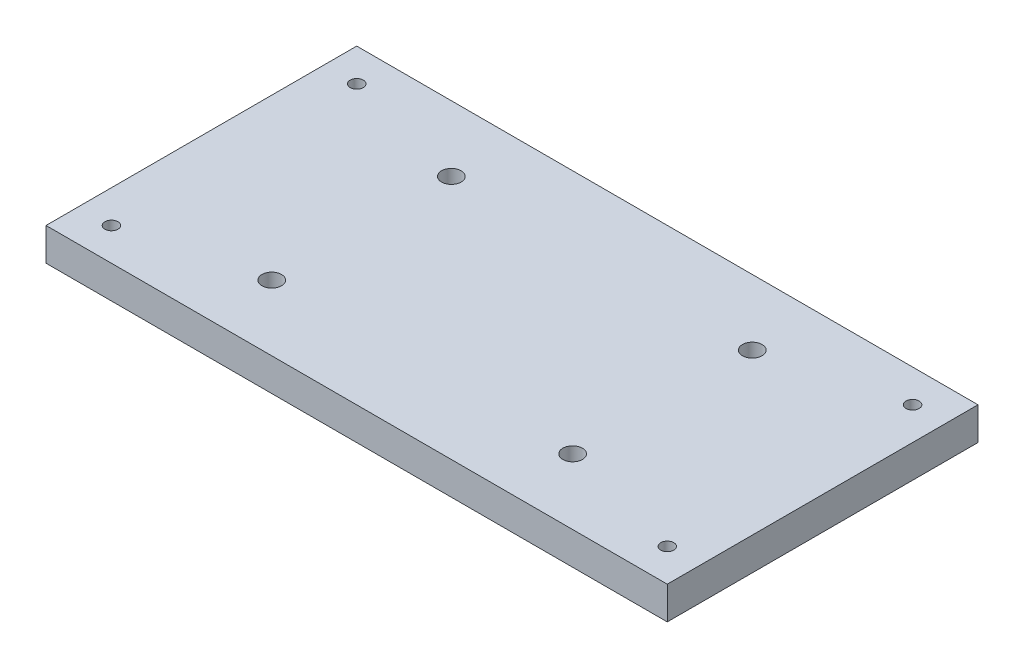
ISO-10303-21;
HEADER;
FILE_DESCRIPTION(('STEP AP214'),'2;1');
FILE_NAME('part.step','',(''),(''),'','','');
FILE_SCHEMA(('AUTOMOTIVE_DESIGN { 1 0 10303 214 1 1 1 1 }'));
ENDSEC;
DATA;
#1=APPLICATION_CONTEXT('core data for automotive mechanical design processes');
#2=APPLICATION_PROTOCOL_DEFINITION('international standard','automotive_design',2000,#1);
#3=PRODUCT_CONTEXT('',#1,'mechanical');
#4=PRODUCT('Part','Part','',(#3));
#5=PRODUCT_RELATED_PRODUCT_CATEGORY('part','',(#4));
#6=PRODUCT_DEFINITION_FORMATION('','',#4);
#7=PRODUCT_DEFINITION_CONTEXT('part definition',#1,'design');
#8=PRODUCT_DEFINITION('design','',#6,#7);
#9=PRODUCT_DEFINITION_SHAPE('','',#8);
#10=(LENGTH_UNIT() NAMED_UNIT(*) SI_UNIT(.MILLI.,.METRE.));
#11=(NAMED_UNIT(*) PLANE_ANGLE_UNIT() SI_UNIT($,.RADIAN.));
#12=(NAMED_UNIT(*) SI_UNIT($,.STERADIAN.) SOLID_ANGLE_UNIT());
#13=UNCERTAINTY_MEASURE_WITH_UNIT(LENGTH_MEASURE(1.E-05),#10,'distance_accuracy_value','');
#14=(GEOMETRIC_REPRESENTATION_CONTEXT(3) GLOBAL_UNCERTAINTY_ASSIGNED_CONTEXT((#13)) GLOBAL_UNIT_ASSIGNED_CONTEXT((#10,
#11,#12)) REPRESENTATION_CONTEXT('',''));
#15=CARTESIAN_POINT('',(0.,0.,0.));
#16=DIRECTION('',(0.,0.,1.));
#17=DIRECTION('',(1.,0.,0.));
#18=AXIS2_PLACEMENT_3D('',#15,#16,#17);
#19=CARTESIAN_POINT('',(0.,10.,52.7085041409592));
#20=DIRECTION('',(0.,0.,1.));
#21=DIRECTION('',(1.,0.,0.));
#22=AXIS2_PLACEMENT_3D('',#19,#20,#21);
#23=PLANE('',#22);
#24=DIRECTION('',(-1.,0.,0.));
#25=VECTOR('',#24,1.);
#26=CARTESIAN_POINT('',(0.,0.,52.7085041409592));
#27=LINE('',#26,#25);
#28=CARTESIAN_POINT('',(88.5827377095665,0.,52.7085041409592));
#29=VERTEX_POINT('',#28);
#30=CARTESIAN_POINT('',(-101.367262290434,0.,52.7085041409592));
#31=VERTEX_POINT('',#30);
#32=EDGE_CURVE('E121',#29,#31,#27,.T.);
#33=ORIENTED_EDGE('',*,*,#32,.F.);
#34=DIRECTION('',(0.,-1.,0.));
#35=VECTOR('',#34,1.);
#36=CARTESIAN_POINT('',(88.5827377095665,10.,52.7085041409592));
#37=LINE('',#36,#35);
#38=CARTESIAN_POINT('',(88.5827377095665,10.,52.7085041409592));
#39=VERTEX_POINT('',#38);
#40=EDGE_CURVE('E11',#39,#29,#37,.T.);
#41=ORIENTED_EDGE('',*,*,#40,.F.);
#42=DIRECTION('',(-1.,0.,0.));
#43=VECTOR('',#42,1.);
#44=CARTESIAN_POINT('',(0.,10.,52.7085041409592));
#45=LINE('',#44,#43);
#46=CARTESIAN_POINT('',(-101.367262290434,10.,52.7085041409592));
#47=VERTEX_POINT('',#46);
#48=EDGE_CURVE('E93',#39,#47,#45,.T.);
#49=ORIENTED_EDGE('',*,*,#48,.T.);
#50=DIRECTION('',(0.,-1.,0.));
#51=VECTOR('',#50,1.);
#52=CARTESIAN_POINT('',(-101.367262290434,10.,52.7085041409592));
#53=LINE('',#52,#51);
#54=EDGE_CURVE('E73',#47,#31,#53,.T.);
#55=ORIENTED_EDGE('',*,*,#54,.T.);
#56=EDGE_LOOP('',(#33,#41,#49,#55));
#57=FACE_BOUND('',#56,.T.);
#58=ADVANCED_FACE('F35',(#57),#23,.T.);
#59=CARTESIAN_POINT('',(88.5827377095665,10.,0.));
#60=DIRECTION('',(1.,0.,0.));
#61=DIRECTION('',(0.,0.,-1.));
#62=AXIS2_PLACEMENT_3D('',#59,#60,#61);
#63=PLANE('',#62);
#64=DIRECTION('',(0.,0.,1.));
#65=VECTOR('',#64,1.);
#66=CARTESIAN_POINT('',(88.5827377095665,0.,0.));
#67=LINE('',#66,#65);
#68=CARTESIAN_POINT('',(88.5827377095665,0.,-42.2914958590408));
#69=VERTEX_POINT('',#68);
#70=EDGE_CURVE('E86',#69,#29,#67,.T.);
#71=ORIENTED_EDGE('',*,*,#70,.F.);
#72=DIRECTION('',(0.,-1.,0.));
#73=VECTOR('',#72,1.);
#74=CARTESIAN_POINT('',(88.5827377095665,10.,-42.2914958590408));
#75=LINE('',#74,#73);
#76=CARTESIAN_POINT('',(88.5827377095665,10.,-42.2914958590408));
#77=VERTEX_POINT('',#76);
#78=EDGE_CURVE('E43',#77,#69,#75,.T.);
#79=ORIENTED_EDGE('',*,*,#78,.F.);
#80=DIRECTION('',(0.,0.,1.));
#81=VECTOR('',#80,1.);
#82=CARTESIAN_POINT('',(88.5827377095665,10.,0.));
#83=LINE('',#82,#81);
#84=EDGE_CURVE('E84',#77,#39,#83,.T.);
#85=ORIENTED_EDGE('',*,*,#84,.T.);
#86=ORIENTED_EDGE('',*,*,#40,.T.);
#87=EDGE_LOOP('',(#71,#79,#85,#86));
#88=FACE_BOUND('',#87,.T.);
#89=ADVANCED_FACE('F82',(#88),#63,.T.);
#90=CARTESIAN_POINT('',(0.,10.,-42.2914958590408));
#91=DIRECTION('',(0.,0.,1.));
#92=DIRECTION('',(1.,0.,0.));
#93=AXIS2_PLACEMENT_3D('',#90,#91,#92);
#94=PLANE('',#93);
#95=DIRECTION('',(-1.,0.,0.));
#96=VECTOR('',#95,1.);
#97=CARTESIAN_POINT('',(0.,0.,-42.2914958590408));
#98=LINE('',#97,#96);
#99=CARTESIAN_POINT('',(-101.367262290434,0.,-42.2914958590408));
#100=VERTEX_POINT('',#99);
#101=EDGE_CURVE('E66',#69,#100,#98,.T.);
#102=ORIENTED_EDGE('',*,*,#101,.T.);
#103=DIRECTION('',(0.,-1.,0.));
#104=VECTOR('',#103,1.);
#105=CARTESIAN_POINT('',(-101.367262290434,10.,-42.2914958590408));
#106=LINE('',#105,#104);
#107=CARTESIAN_POINT('',(-101.367262290434,10.,-42.2914958590408));
#108=VERTEX_POINT('',#107);
#109=EDGE_CURVE('E87',#108,#100,#106,.T.);
#110=ORIENTED_EDGE('',*,*,#109,.F.);
#111=DIRECTION('',(-1.,0.,0.));
#112=VECTOR('',#111,1.);
#113=CARTESIAN_POINT('',(0.,10.,-42.2914958590408));
#114=LINE('',#113,#112);
#115=EDGE_CURVE('E88',#77,#108,#114,.T.);
#116=ORIENTED_EDGE('',*,*,#115,.F.);
#117=ORIENTED_EDGE('',*,*,#78,.T.);
#118=EDGE_LOOP('',(#102,#110,#116,#117));
#119=FACE_BOUND('',#118,.T.);
#120=ADVANCED_FACE('F89',(#119),#94,.F.);
#121=CARTESIAN_POINT('',(78.5827377095664,10.,-32.2914958590408));
#122=DIRECTION('',(0.,-1.,0.));
#123=DIRECTION('',(0.,0.,-1.));
#124=AXIS2_PLACEMENT_3D('',#121,#122,#123);
#125=CYLINDRICAL_SURFACE('',#124,2.);
#126=CARTESIAN_POINT('',(78.5827377095664,10.,-32.2914958590408));
#127=DIRECTION('',(0.,1.,0.));
#128=DIRECTION('',(0.,0.,1.));
#129=AXIS2_PLACEMENT_3D('',#126,#127,#128);
#130=CIRCLE('',#129,2.);
#131=CARTESIAN_POINT('',(78.5827377095664,10.,-30.2914958590408));
#132=VERTEX_POINT('',#131);
#133=EDGE_CURVE('E115',#132,#132,#130,.F.);
#134=ORIENTED_EDGE('',*,*,#133,.F.);
#135=EDGE_LOOP('',(#134));
#136=FACE_BOUND('',#135,.T.);
#137=CARTESIAN_POINT('',(78.5827377095664,0.,-32.2914958590408));
#138=DIRECTION('',(0.,1.,0.));
#139=DIRECTION('',(0.,0.,1.));
#140=AXIS2_PLACEMENT_3D('',#137,#138,#139);
#141=CIRCLE('',#140,2.);
#142=CARTESIAN_POINT('',(78.5827377095664,0.,-30.2914958590408));
#143=VERTEX_POINT('',#142);
#144=EDGE_CURVE('E144',#143,#143,#141,.F.);
#145=ORIENTED_EDGE('',*,*,#144,.T.);
#146=EDGE_LOOP('',(#145));
#147=FACE_BOUND('',#146,.T.);
#148=ADVANCED_FACE('F163',(#136,#147),#125,.F.);
#149=CARTESIAN_POINT('',(39.6077377095665,10.,-22.2514958590408));
#150=DIRECTION('',(0.,-1.,0.));
#151=DIRECTION('',(0.,0.,-1.));
#152=AXIS2_PLACEMENT_3D('',#149,#150,#151);
#153=CYLINDRICAL_SURFACE('',#152,3.);
#154=CARTESIAN_POINT('',(39.6077377095665,10.,-22.2514958590408));
#155=DIRECTION('',(0.,1.,0.));
#156=DIRECTION('',(0.,0.,1.));
#157=AXIS2_PLACEMENT_3D('',#154,#155,#156);
#158=CIRCLE('',#157,3.);
#159=CARTESIAN_POINT('',(39.6077377095665,10.,-19.2514958590408));
#160=VERTEX_POINT('',#159);
#161=EDGE_CURVE('E112',#160,#160,#158,.T.);
#162=ORIENTED_EDGE('',*,*,#161,.T.);
#163=EDGE_LOOP('',(#162));
#164=FACE_BOUND('',#163,.T.);
#165=CARTESIAN_POINT('',(39.6077377095665,0.,-22.2514958590408));
#166=DIRECTION('',(0.,1.,0.));
#167=DIRECTION('',(0.,0.,1.));
#168=AXIS2_PLACEMENT_3D('',#165,#166,#167);
#169=CIRCLE('',#168,3.);
#170=CARTESIAN_POINT('',(39.6077377095665,0.,-19.2514958590408));
#171=VERTEX_POINT('',#170);
#172=EDGE_CURVE('E141',#171,#171,#169,.T.);
#173=ORIENTED_EDGE('',*,*,#172,.F.);
#174=EDGE_LOOP('',(#173));
#175=FACE_BOUND('',#174,.T.);
#176=ADVANCED_FACE('F184',(#164,#175),#153,.F.);
#177=CARTESIAN_POINT('',(-91.3672622904335,10.,42.7085041409592));
#178=DIRECTION('',(0.,-1.,0.));
#179=DIRECTION('',(0.,0.,-1.));
#180=AXIS2_PLACEMENT_3D('',#177,#178,#179);
#181=CYLINDRICAL_SURFACE('',#180,2.);
#182=CARTESIAN_POINT('',(-91.3672622904335,10.,42.7085041409592));
#183=DIRECTION('',(0.,1.,0.));
#184=DIRECTION('',(0.,0.,1.));
#185=AXIS2_PLACEMENT_3D('',#182,#183,#184);
#186=CIRCLE('',#185,2.);
#187=CARTESIAN_POINT('',(-91.3672622904335,10.,44.7085041409592));
#188=VERTEX_POINT('',#187);
#189=EDGE_CURVE('E109',#188,#188,#186,.F.);
#190=ORIENTED_EDGE('',*,*,#189,.F.);
#191=EDGE_LOOP('',(#190));
#192=FACE_BOUND('',#191,.T.);
#193=CARTESIAN_POINT('',(-91.3672622904335,0.,42.7085041409592));
#194=DIRECTION('',(0.,1.,0.));
#195=DIRECTION('',(0.,0.,1.));
#196=AXIS2_PLACEMENT_3D('',#193,#194,#195);
#197=CIRCLE('',#196,2.);
#198=CARTESIAN_POINT('',(-91.3672622904335,0.,44.7085041409592));
#199=VERTEX_POINT('',#198);
#200=EDGE_CURVE('E138',#199,#199,#197,.F.);
#201=ORIENTED_EDGE('',*,*,#200,.T.);
#202=EDGE_LOOP('',(#201));
#203=FACE_BOUND('',#202,.T.);
#204=ADVANCED_FACE('F180',(#192,#203),#181,.F.);
#205=CARTESIAN_POINT('',(-52.3922622904335,10.,32.6685041409592));
#206=DIRECTION('',(0.,-1.,0.));
#207=DIRECTION('',(0.,0.,-1.));
#208=AXIS2_PLACEMENT_3D('',#205,#206,#207);
#209=CYLINDRICAL_SURFACE('',#208,3.);
#210=CARTESIAN_POINT('',(-52.3922622904335,10.,32.6685041409592));
#211=DIRECTION('',(0.,1.,0.));
#212=DIRECTION('',(0.,0.,1.));
#213=AXIS2_PLACEMENT_3D('',#210,#211,#212);
#214=CIRCLE('',#213,3.);
#215=CARTESIAN_POINT('',(-52.3922622904335,10.,35.6685041409592));
#216=VERTEX_POINT('',#215);
#217=EDGE_CURVE('E106',#216,#216,#214,.T.);
#218=ORIENTED_EDGE('',*,*,#217,.T.);
#219=EDGE_LOOP('',(#218));
#220=FACE_BOUND('',#219,.T.);
#221=CARTESIAN_POINT('',(-52.3922622904335,0.,32.6685041409592));
#222=DIRECTION('',(0.,1.,0.));
#223=DIRECTION('',(0.,0.,1.));
#224=AXIS2_PLACEMENT_3D('',#221,#222,#223);
#225=CIRCLE('',#224,3.);
#226=CARTESIAN_POINT('',(-52.3922622904335,0.,35.6685041409592));
#227=VERTEX_POINT('',#226);
#228=EDGE_CURVE('E135',#227,#227,#225,.T.);
#229=ORIENTED_EDGE('',*,*,#228,.F.);
#230=EDGE_LOOP('',(#229));
#231=FACE_BOUND('',#230,.T.);
#232=ADVANCED_FACE('F176',(#220,#231),#209,.F.);
#233=CARTESIAN_POINT('',(-91.3672622904335,10.,-32.2914958590408));
#234=DIRECTION('',(0.,-1.,0.));
#235=DIRECTION('',(0.,0.,-1.));
#236=AXIS2_PLACEMENT_3D('',#233,#234,#235);
#237=CYLINDRICAL_SURFACE('',#236,2.);
#238=CARTESIAN_POINT('',(-91.3672622904335,10.,-32.2914958590408));
#239=DIRECTION('',(0.,1.,0.));
#240=DIRECTION('',(0.,0.,1.));
#241=AXIS2_PLACEMENT_3D('',#238,#239,#240);
#242=CIRCLE('',#241,2.);
#243=CARTESIAN_POINT('',(-91.3672622904335,10.,-30.2914958590408));
#244=VERTEX_POINT('',#243);
#245=EDGE_CURVE('E103',#244,#244,#242,.T.);
#246=ORIENTED_EDGE('',*,*,#245,.T.);
#247=EDGE_LOOP('',(#246));
#248=FACE_BOUND('',#247,.T.);
#249=CARTESIAN_POINT('',(-91.3672622904335,0.,-32.2914958590408));
#250=DIRECTION('',(0.,1.,0.));
#251=DIRECTION('',(0.,0.,1.));
#252=AXIS2_PLACEMENT_3D('',#249,#250,#251);
#253=CIRCLE('',#252,2.);
#254=CARTESIAN_POINT('',(-91.3672622904335,0.,-30.2914958590408));
#255=VERTEX_POINT('',#254);
#256=EDGE_CURVE('E132',#255,#255,#253,.T.);
#257=ORIENTED_EDGE('',*,*,#256,.F.);
#258=EDGE_LOOP('',(#257));
#259=FACE_BOUND('',#258,.T.);
#260=ADVANCED_FACE('F172',(#248,#259),#237,.F.);
#261=CARTESIAN_POINT('',(-52.3922622904335,10.,-22.2514958590408));
#262=DIRECTION('',(0.,-1.,0.));
#263=DIRECTION('',(0.,0.,-1.));
#264=AXIS2_PLACEMENT_3D('',#261,#262,#263);
#265=CYLINDRICAL_SURFACE('',#264,3.);
#266=CARTESIAN_POINT('',(-52.3922622904335,10.,-22.2514958590408));
#267=DIRECTION('',(0.,1.,0.));
#268=DIRECTION('',(0.,0.,1.));
#269=AXIS2_PLACEMENT_3D('',#266,#267,#268);
#270=CIRCLE('',#269,3.);
#271=CARTESIAN_POINT('',(-52.3922622904335,10.,-19.2514958590408));
#272=VERTEX_POINT('',#271);
#273=EDGE_CURVE('E100',#272,#272,#270,.T.);
#274=ORIENTED_EDGE('',*,*,#273,.T.);
#275=EDGE_LOOP('',(#274));
#276=FACE_BOUND('',#275,.T.);
#277=CARTESIAN_POINT('',(-52.3922622904335,0.,-22.2514958590408));
#278=DIRECTION('',(0.,1.,0.));
#279=DIRECTION('',(0.,0.,1.));
#280=AXIS2_PLACEMENT_3D('',#277,#278,#279);
#281=CIRCLE('',#280,3.);
#282=CARTESIAN_POINT('',(-52.3922622904335,0.,-19.2514958590408));
#283=VERTEX_POINT('',#282);
#284=EDGE_CURVE('E129',#283,#283,#281,.T.);
#285=ORIENTED_EDGE('',*,*,#284,.F.);
#286=EDGE_LOOP('',(#285));
#287=FACE_BOUND('',#286,.T.);
#288=ADVANCED_FACE('F169',(#276,#287),#265,.F.);
#289=CARTESIAN_POINT('',(-101.367262290434,10.,0.));
#290=DIRECTION('',(1.,0.,0.));
#291=DIRECTION('',(0.,0.,-1.));
#292=AXIS2_PLACEMENT_3D('',#289,#290,#291);
#293=PLANE('',#292);
#294=DIRECTION('',(0.,0.,1.));
#295=VECTOR('',#294,1.);
#296=CARTESIAN_POINT('',(-101.367262290434,0.,0.));
#297=LINE('',#296,#295);
#298=EDGE_CURVE('E127',#100,#31,#297,.T.);
#299=ORIENTED_EDGE('',*,*,#298,.T.);
#300=ORIENTED_EDGE('',*,*,#54,.F.);
#301=DIRECTION('',(0.,0.,1.));
#302=VECTOR('',#301,1.);
#303=CARTESIAN_POINT('',(-101.367262290434,10.,0.));
#304=LINE('',#303,#302);
#305=EDGE_CURVE('E51',#108,#47,#304,.T.);
#306=ORIENTED_EDGE('',*,*,#305,.F.);
#307=ORIENTED_EDGE('',*,*,#109,.T.);
#308=EDGE_LOOP('',(#299,#300,#306,#307));
#309=FACE_BOUND('',#308,.T.);
#310=ADVANCED_FACE('F152',(#309),#293,.F.);
#311=CARTESIAN_POINT('',(78.5827377095665,10.,42.7085041409592));
#312=DIRECTION('',(0.,-1.,0.));
#313=DIRECTION('',(0.,0.,-1.));
#314=AXIS2_PLACEMENT_3D('',#311,#312,#313);
#315=CYLINDRICAL_SURFACE('',#314,2.);
#316=CARTESIAN_POINT('',(78.5827377095665,10.,42.7085041409592));
#317=DIRECTION('',(0.,1.,0.));
#318=DIRECTION('',(0.,0.,1.));
#319=AXIS2_PLACEMENT_3D('',#316,#317,#318);
#320=CIRCLE('',#319,2.);
#321=CARTESIAN_POINT('',(78.5827377095665,10.,44.7085041409591));
#322=VERTEX_POINT('',#321);
#323=EDGE_CURVE('E118',#322,#322,#320,.T.);
#324=ORIENTED_EDGE('',*,*,#323,.T.);
#325=EDGE_LOOP('',(#324));
#326=FACE_BOUND('',#325,.T.);
#327=CARTESIAN_POINT('',(78.5827377095665,0.,42.7085041409592));
#328=DIRECTION('',(0.,1.,0.));
#329=DIRECTION('',(0.,0.,1.));
#330=AXIS2_PLACEMENT_3D('',#327,#328,#329);
#331=CIRCLE('',#330,2.);
#332=CARTESIAN_POINT('',(78.5827377095665,0.,44.7085041409591));
#333=VERTEX_POINT('',#332);
#334=EDGE_CURVE('E95',#333,#333,#331,.T.);
#335=ORIENTED_EDGE('',*,*,#334,.F.);
#336=EDGE_LOOP('',(#335));
#337=FACE_BOUND('',#336,.T.);
#338=ADVANCED_FACE('F168',(#326,#337),#315,.F.);
#339=CARTESIAN_POINT('',(0.,10.,0.));
#340=DIRECTION('',(0.,1.,0.));
#341=DIRECTION('',(0.,0.,1.));
#342=AXIS2_PLACEMENT_3D('',#339,#340,#341);
#343=PLANE('',#342);
#344=CARTESIAN_POINT('',(39.6077377095665,10.,32.6685041409592));
#345=DIRECTION('',(0.,1.,0.));
#346=DIRECTION('',(0.,0.,1.));
#347=AXIS2_PLACEMENT_3D('',#344,#345,#346);
#348=CIRCLE('',#347,3.);
#349=CARTESIAN_POINT('',(39.6077377095665,10.,35.6685041409592));
#350=VERTEX_POINT('',#349);
#351=EDGE_CURVE('E124',#350,#350,#348,.F.);
#352=ORIENTED_EDGE('',*,*,#351,.T.);
#353=EDGE_LOOP('',(#352));
#354=FACE_BOUND('',#353,.T.);
#355=ORIENTED_EDGE('',*,*,#48,.F.);
#356=ORIENTED_EDGE('',*,*,#84,.F.);
#357=ORIENTED_EDGE('',*,*,#115,.T.);
#358=ORIENTED_EDGE('',*,*,#305,.T.);
#359=EDGE_LOOP('',(#355,#356,#357,#358));
#360=FACE_BOUND('',#359,.T.);
#361=ORIENTED_EDGE('',*,*,#273,.F.);
#362=EDGE_LOOP('',(#361));
#363=FACE_BOUND('',#362,.T.);
#364=ORIENTED_EDGE('',*,*,#245,.F.);
#365=EDGE_LOOP('',(#364));
#366=FACE_BOUND('',#365,.T.);
#367=ORIENTED_EDGE('',*,*,#217,.F.);
#368=EDGE_LOOP('',(#367));
#369=FACE_BOUND('',#368,.T.);
#370=ORIENTED_EDGE('',*,*,#189,.T.);
#371=EDGE_LOOP('',(#370));
#372=FACE_BOUND('',#371,.T.);
#373=ORIENTED_EDGE('',*,*,#161,.F.);
#374=EDGE_LOOP('',(#373));
#375=FACE_BOUND('',#374,.T.);
#376=ORIENTED_EDGE('',*,*,#133,.T.);
#377=EDGE_LOOP('',(#376));
#378=FACE_BOUND('',#377,.T.);
#379=ORIENTED_EDGE('',*,*,#323,.F.);
#380=EDGE_LOOP('',(#379));
#381=FACE_BOUND('',#380,.T.);
#382=ADVANCED_FACE('F91',(#354,#360,#363,#366,#369,#372,#375,#378,#381),#343,.T.);
#383=CARTESIAN_POINT('',(0.,0.,0.));
#384=DIRECTION('',(0.,1.,0.));
#385=DIRECTION('',(0.,0.,1.));
#386=AXIS2_PLACEMENT_3D('',#383,#384,#385);
#387=PLANE('',#386);
#388=CARTESIAN_POINT('',(39.6077377095665,0.,32.6685041409592));
#389=DIRECTION('',(0.,1.,0.));
#390=DIRECTION('',(0.,0.,1.));
#391=AXIS2_PLACEMENT_3D('',#388,#389,#390);
#392=CIRCLE('',#391,3.);
#393=CARTESIAN_POINT('',(39.6077377095665,0.,35.6685041409592));
#394=VERTEX_POINT('',#393);
#395=EDGE_CURVE('E211',#394,#394,#392,.T.);
#396=ORIENTED_EDGE('',*,*,#395,.T.);
#397=EDGE_LOOP('',(#396));
#398=FACE_BOUND('',#397,.T.);
#399=ORIENTED_EDGE('',*,*,#32,.T.);
#400=ORIENTED_EDGE('',*,*,#298,.F.);
#401=ORIENTED_EDGE('',*,*,#101,.F.);
#402=ORIENTED_EDGE('',*,*,#70,.T.);
#403=EDGE_LOOP('',(#399,#400,#401,#402));
#404=FACE_BOUND('',#403,.T.);
#405=ORIENTED_EDGE('',*,*,#284,.T.);
#406=EDGE_LOOP('',(#405));
#407=FACE_BOUND('',#406,.T.);
#408=ORIENTED_EDGE('',*,*,#256,.T.);
#409=EDGE_LOOP('',(#408));
#410=FACE_BOUND('',#409,.T.);
#411=ORIENTED_EDGE('',*,*,#228,.T.);
#412=EDGE_LOOP('',(#411));
#413=FACE_BOUND('',#412,.T.);
#414=ORIENTED_EDGE('',*,*,#200,.F.);
#415=EDGE_LOOP('',(#414));
#416=FACE_BOUND('',#415,.T.);
#417=ORIENTED_EDGE('',*,*,#172,.T.);
#418=EDGE_LOOP('',(#417));
#419=FACE_BOUND('',#418,.T.);
#420=ORIENTED_EDGE('',*,*,#144,.F.);
#421=EDGE_LOOP('',(#420));
#422=FACE_BOUND('',#421,.T.);
#423=ORIENTED_EDGE('',*,*,#334,.T.);
#424=EDGE_LOOP('',(#423));
#425=FACE_BOUND('',#424,.T.);
#426=ADVANCED_FACE('F154',(#398,#404,#407,#410,#413,#416,#419,#422,#425),#387,.F.);
#427=CARTESIAN_POINT('',(39.6077377095665,35.,32.6685041409592));
#428=DIRECTION('',(0.,-1.,0.));
#429=DIRECTION('',(0.,0.,-1.));
#430=AXIS2_PLACEMENT_3D('',#427,#428,#429);
#431=CYLINDRICAL_SURFACE('',#430,3.);
#432=ORIENTED_EDGE('',*,*,#351,.F.);
#433=EDGE_LOOP('',(#432));
#434=FACE_BOUND('',#433,.T.);
#435=ORIENTED_EDGE('',*,*,#395,.F.);
#436=EDGE_LOOP('',(#435));
#437=FACE_BOUND('',#436,.T.);
#438=ADVANCED_FACE('F197',(#434,#437),#431,.F.);
#439=CLOSED_SHELL('',(#58,#89,#120,#148,#176,#204,#232,#260,#288,#310,#338,#382,#426,#438));
#440=MANIFOLD_SOLID_BREP('B2',#439);
#441=ADVANCED_BREP_SHAPE_REPRESENTATION('',(#18,#440),#14);
#442=SHAPE_DEFINITION_REPRESENTATION(#9,#441);
ENDSEC;
END-ISO-10303-21;
